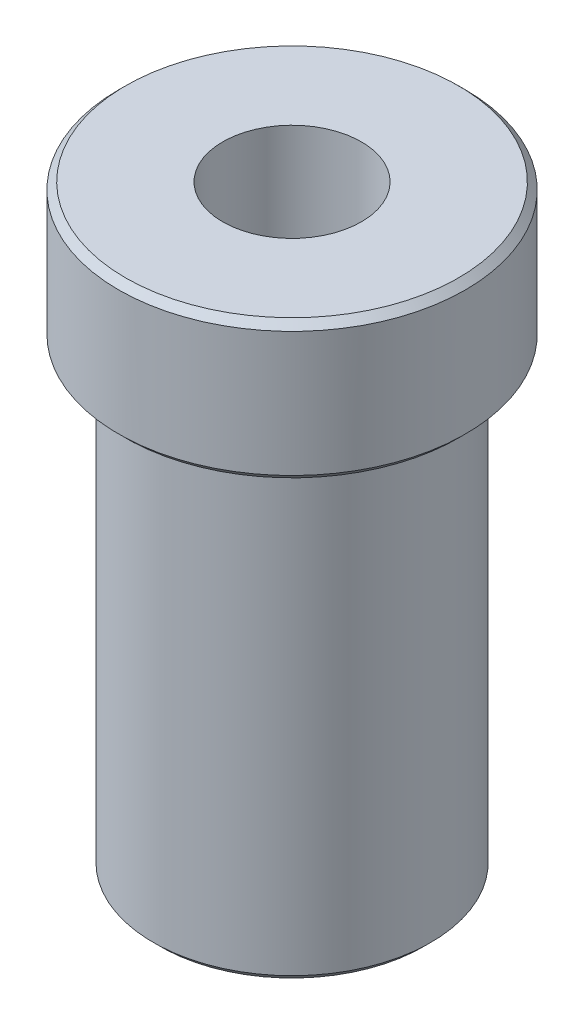
ISO-10303-21;
HEADER;
FILE_DESCRIPTION(('STEP AP214'),'2;1');
FILE_NAME('part.step','',(''),(''),'','','');
FILE_SCHEMA(('AUTOMOTIVE_DESIGN { 1 0 10303 214 1 1 1 1 }'));
ENDSEC;
DATA;
#1=APPLICATION_CONTEXT('core data for automotive mechanical design processes');
#2=APPLICATION_PROTOCOL_DEFINITION('international standard','automotive_design',2000,#1);
#3=PRODUCT_CONTEXT('',#1,'mechanical');
#4=PRODUCT('Part','Part','',(#3));
#5=PRODUCT_RELATED_PRODUCT_CATEGORY('part','',(#4));
#6=PRODUCT_DEFINITION_FORMATION('','',#4);
#7=PRODUCT_DEFINITION_CONTEXT('part definition',#1,'design');
#8=PRODUCT_DEFINITION('design','',#6,#7);
#9=PRODUCT_DEFINITION_SHAPE('','',#8);
#10=(LENGTH_UNIT() NAMED_UNIT(*) SI_UNIT(.MILLI.,.METRE.));
#11=(NAMED_UNIT(*) PLANE_ANGLE_UNIT() SI_UNIT($,.RADIAN.));
#12=(NAMED_UNIT(*) SI_UNIT($,.STERADIAN.) SOLID_ANGLE_UNIT());
#13=UNCERTAINTY_MEASURE_WITH_UNIT(LENGTH_MEASURE(1.E-05),#10,'distance_accuracy_value','');
#14=(GEOMETRIC_REPRESENTATION_CONTEXT(3) GLOBAL_UNCERTAINTY_ASSIGNED_CONTEXT((#13)) GLOBAL_UNIT_ASSIGNED_CONTEXT((#10,
#11,#12)) REPRESENTATION_CONTEXT('',''));
#15=CARTESIAN_POINT('',(0.,0.,0.));
#16=DIRECTION('',(0.,0.,1.));
#17=DIRECTION('',(1.,0.,0.));
#18=AXIS2_PLACEMENT_3D('',#15,#16,#17);
#19=CARTESIAN_POINT('',(-2.84653465346534,10.,0.));
#20=DIRECTION('',(0.,1.,0.));
#21=DIRECTION('',(0.,0.,1.));
#22=AXIS2_PLACEMENT_3D('',#19,#20,#21);
#23=PLANE('',#22);
#24=CARTESIAN_POINT('',(-2.84653465346534,10.,0.));
#25=DIRECTION('',(0.,1.,0.));
#26=DIRECTION('',(0.,0.,1.));
#27=AXIS2_PLACEMENT_3D('',#24,#25,#26);
#28=CIRCLE('',#27,12.);
#29=CARTESIAN_POINT('',(-2.84653465346534,10.,12.));
#30=VERTEX_POINT('',#29);
#31=EDGE_CURVE('E10',#30,#30,#28,.T.);
#32=ORIENTED_EDGE('',*,*,#31,.T.);
#33=EDGE_LOOP('',(#32));
#34=FACE_BOUND('',#33,.T.);
#35=CARTESIAN_POINT('',(-2.84653465346534,10.,0.));
#36=DIRECTION('',(0.,1.,0.));
#37=DIRECTION('',(0.,0.,1.));
#38=AXIS2_PLACEMENT_3D('',#35,#36,#37);
#39=CIRCLE('',#38,5.);
#40=CARTESIAN_POINT('',(-2.84653465346534,10.,5.));
#41=VERTEX_POINT('',#40);
#42=EDGE_CURVE('E61',#41,#41,#39,.T.);
#43=ORIENTED_EDGE('',*,*,#42,.F.);
#44=EDGE_LOOP('',(#43));
#45=FACE_BOUND('',#44,.T.);
#46=ADVANCED_FACE('F31',(#34,#45),#23,.T.);
#47=CARTESIAN_POINT('',(-2.84653465346534,-33.,0.));
#48=DIRECTION('',(0.,-1.,0.));
#49=DIRECTION('',(0.,0.,-1.));
#50=AXIS2_PLACEMENT_3D('',#47,#48,#49);
#51=CYLINDRICAL_SURFACE('',#50,12.5);
#52=CARTESIAN_POINT('',(-2.84653465346534,0.500000000000007,0.));
#53=DIRECTION('',(0.,-1.,0.));
#54=DIRECTION('',(0.,0.,-1.));
#55=AXIS2_PLACEMENT_3D('',#52,#53,#54);
#56=CIRCLE('',#55,12.5);
#57=CARTESIAN_POINT('',(-2.84653465346534,0.500000000000007,-12.5));
#58=VERTEX_POINT('',#57);
#59=EDGE_CURVE('E38',#58,#58,#56,.F.);
#60=ORIENTED_EDGE('',*,*,#59,.T.);
#61=EDGE_LOOP('',(#60));
#62=FACE_BOUND('',#61,.T.);
#63=CARTESIAN_POINT('',(-2.84653465346534,9.50000000000001,0.));
#64=DIRECTION('',(0.,1.,0.));
#65=DIRECTION('',(0.,0.,1.));
#66=AXIS2_PLACEMENT_3D('',#63,#64,#65);
#67=CIRCLE('',#66,12.5);
#68=CARTESIAN_POINT('',(-2.84653465346534,9.50000000000001,12.5));
#69=VERTEX_POINT('',#68);
#70=EDGE_CURVE('E42',#69,#69,#67,.F.);
#71=ORIENTED_EDGE('',*,*,#70,.T.);
#72=EDGE_LOOP('',(#71));
#73=FACE_BOUND('',#72,.T.);
#74=ADVANCED_FACE('F77',(#62,#73),#51,.T.);
#75=CARTESIAN_POINT('',(9.65346534653466,0.,0.));
#76=DIRECTION('',(0.,-1.,0.));
#77=DIRECTION('',(0.,0.,-1.));
#78=AXIS2_PLACEMENT_3D('',#75,#76,#77);
#79=PLANE('',#78);
#80=CARTESIAN_POINT('',(-2.84653465346534,0.,0.));
#81=DIRECTION('',(0.,-1.,0.));
#82=DIRECTION('',(0.,0.,-1.));
#83=AXIS2_PLACEMENT_3D('',#80,#81,#82);
#84=CIRCLE('',#83,12.);
#85=CARTESIAN_POINT('',(-2.84653465346534,0.,-12.));
#86=VERTEX_POINT('',#85);
#87=EDGE_CURVE('E46',#86,#86,#84,.T.);
#88=ORIENTED_EDGE('',*,*,#87,.T.);
#89=EDGE_LOOP('',(#88));
#90=FACE_BOUND('',#89,.T.);
#91=CARTESIAN_POINT('',(-2.84653465346534,0.,0.));
#92=DIRECTION('',(0.,-1.,0.));
#93=DIRECTION('',(0.,0.,-1.));
#94=AXIS2_PLACEMENT_3D('',#91,#92,#93);
#95=CIRCLE('',#94,9.99999999999999);
#96=CARTESIAN_POINT('',(-2.84653465346534,0.,-9.99999999999999));
#97=VERTEX_POINT('',#96);
#98=EDGE_CURVE('E57',#97,#97,#95,.T.);
#99=ORIENTED_EDGE('',*,*,#98,.F.);
#100=EDGE_LOOP('',(#99));
#101=FACE_BOUND('',#100,.T.);
#102=ADVANCED_FACE('F82',(#90,#101),#79,.T.);
#103=CARTESIAN_POINT('',(-2.84653465346534,-33.,0.));
#104=DIRECTION('',(0.,-1.,0.));
#105=DIRECTION('',(0.,0.,-1.));
#106=AXIS2_PLACEMENT_3D('',#103,#104,#105);
#107=CYLINDRICAL_SURFACE('',#106,10.);
#108=CARTESIAN_POINT('',(-2.84653465346534,-32.5,0.));
#109=DIRECTION('',(0.,-1.,0.));
#110=DIRECTION('',(0.,0.,-1.));
#111=AXIS2_PLACEMENT_3D('',#108,#109,#110);
#112=CIRCLE('',#111,10.);
#113=CARTESIAN_POINT('',(-2.84653465346534,-32.5,-10.));
#114=VERTEX_POINT('',#113);
#115=EDGE_CURVE('E51',#114,#114,#112,.F.);
#116=ORIENTED_EDGE('',*,*,#115,.T.);
#117=EDGE_LOOP('',(#116));
#118=FACE_BOUND('',#117,.T.);
#119=ORIENTED_EDGE('',*,*,#98,.T.);
#120=EDGE_LOOP('',(#119));
#121=FACE_BOUND('',#120,.T.);
#122=ADVANCED_FACE('F100',(#118,#121),#107,.T.);
#123=CARTESIAN_POINT('',(7.15346534653466,-33.,0.));
#124=DIRECTION('',(0.,-1.,0.));
#125=DIRECTION('',(0.,0.,-1.));
#126=AXIS2_PLACEMENT_3D('',#123,#124,#125);
#127=PLANE('',#126);
#128=CARTESIAN_POINT('',(-2.84653465346534,-33.,0.));
#129=DIRECTION('',(0.,-1.,0.));
#130=DIRECTION('',(0.,0.,-1.));
#131=AXIS2_PLACEMENT_3D('',#128,#129,#130);
#132=CIRCLE('',#131,9.5);
#133=CARTESIAN_POINT('',(-2.84653465346534,-33.,-9.5));
#134=VERTEX_POINT('',#133);
#135=EDGE_CURVE('E54',#134,#134,#132,.T.);
#136=ORIENTED_EDGE('',*,*,#135,.T.);
#137=EDGE_LOOP('',(#136));
#138=FACE_BOUND('',#137,.T.);
#139=CARTESIAN_POINT('',(-2.84653465346534,-33.,0.));
#140=DIRECTION('',(0.,1.,0.));
#141=DIRECTION('',(0.,0.,1.));
#142=AXIS2_PLACEMENT_3D('',#139,#140,#141);
#143=CIRCLE('',#142,5.);
#144=CARTESIAN_POINT('',(-2.84653465346534,-33.,5.));
#145=VERTEX_POINT('',#144);
#146=EDGE_CURVE('E60',#145,#145,#143,.T.);
#147=ORIENTED_EDGE('',*,*,#146,.T.);
#148=EDGE_LOOP('',(#147));
#149=FACE_BOUND('',#148,.T.);
#150=ADVANCED_FACE('F67',(#138,#149),#127,.T.);
#151=CARTESIAN_POINT('',(-2.84653465346534,-33.,0.));
#152=DIRECTION('',(0.,1.,0.));
#153=DIRECTION('',(0.,0.,1.));
#154=AXIS2_PLACEMENT_3D('',#151,#152,#153);
#155=CYLINDRICAL_SURFACE('',#154,5.);
#156=ORIENTED_EDGE('',*,*,#146,.F.);
#157=EDGE_LOOP('',(#156));
#158=FACE_BOUND('',#157,.T.);
#159=ORIENTED_EDGE('',*,*,#42,.T.);
#160=EDGE_LOOP('',(#159));
#161=FACE_BOUND('',#160,.T.);
#162=ADVANCED_FACE('F69',(#158,#161),#155,.F.);
#163=CARTESIAN_POINT('',(-2.84653465346534,-33.,0.));
#164=DIRECTION('',(0.,1.,0.));
#165=DIRECTION('',(0.,0.,1.));
#166=AXIS2_PLACEMENT_3D('',#163,#164,#165);
#167=CONICAL_SURFACE('',#166,9.5,0.785398163397445);
#168=ORIENTED_EDGE('',*,*,#115,.F.);
#169=EDGE_LOOP('',(#168));
#170=FACE_BOUND('',#169,.T.);
#171=ORIENTED_EDGE('',*,*,#135,.F.);
#172=EDGE_LOOP('',(#171));
#173=FACE_BOUND('',#172,.T.);
#174=ADVANCED_FACE('F72',(#170,#173),#167,.T.);
#175=CARTESIAN_POINT('',(-2.84653465346534,0.,0.));
#176=DIRECTION('',(0.,1.,0.));
#177=DIRECTION('',(0.,0.,1.));
#178=AXIS2_PLACEMENT_3D('',#175,#176,#177);
#179=CONICAL_SURFACE('',#178,12.,0.785398163397445);
#180=ORIENTED_EDGE('',*,*,#59,.F.);
#181=EDGE_LOOP('',(#180));
#182=FACE_BOUND('',#181,.T.);
#183=ORIENTED_EDGE('',*,*,#87,.F.);
#184=EDGE_LOOP('',(#183));
#185=FACE_BOUND('',#184,.T.);
#186=ADVANCED_FACE('F87',(#182,#185),#179,.T.);
#187=CARTESIAN_POINT('',(-2.84653465346534,9.50000000000001,0.));
#188=DIRECTION('',(0.,-1.,0.));
#189=DIRECTION('',(0.,0.,-1.));
#190=AXIS2_PLACEMENT_3D('',#187,#188,#189);
#191=CONICAL_SURFACE('',#190,12.5,0.785398163397452);
#192=ORIENTED_EDGE('',*,*,#31,.F.);
#193=EDGE_LOOP('',(#192));
#194=FACE_BOUND('',#193,.T.);
#195=ORIENTED_EDGE('',*,*,#70,.F.);
#196=EDGE_LOOP('',(#195));
#197=FACE_BOUND('',#196,.T.);
#198=ADVANCED_FACE('F33',(#194,#197),#191,.T.);
#199=CLOSED_SHELL('',(#46,#74,#102,#122,#150,#162,#174,#186,#198));
#200=MANIFOLD_SOLID_BREP('B2',#199);
#201=ADVANCED_BREP_SHAPE_REPRESENTATION('',(#18,#200),#14);
#202=SHAPE_DEFINITION_REPRESENTATION(#9,#201);
ENDSEC;
END-ISO-10303-21;
